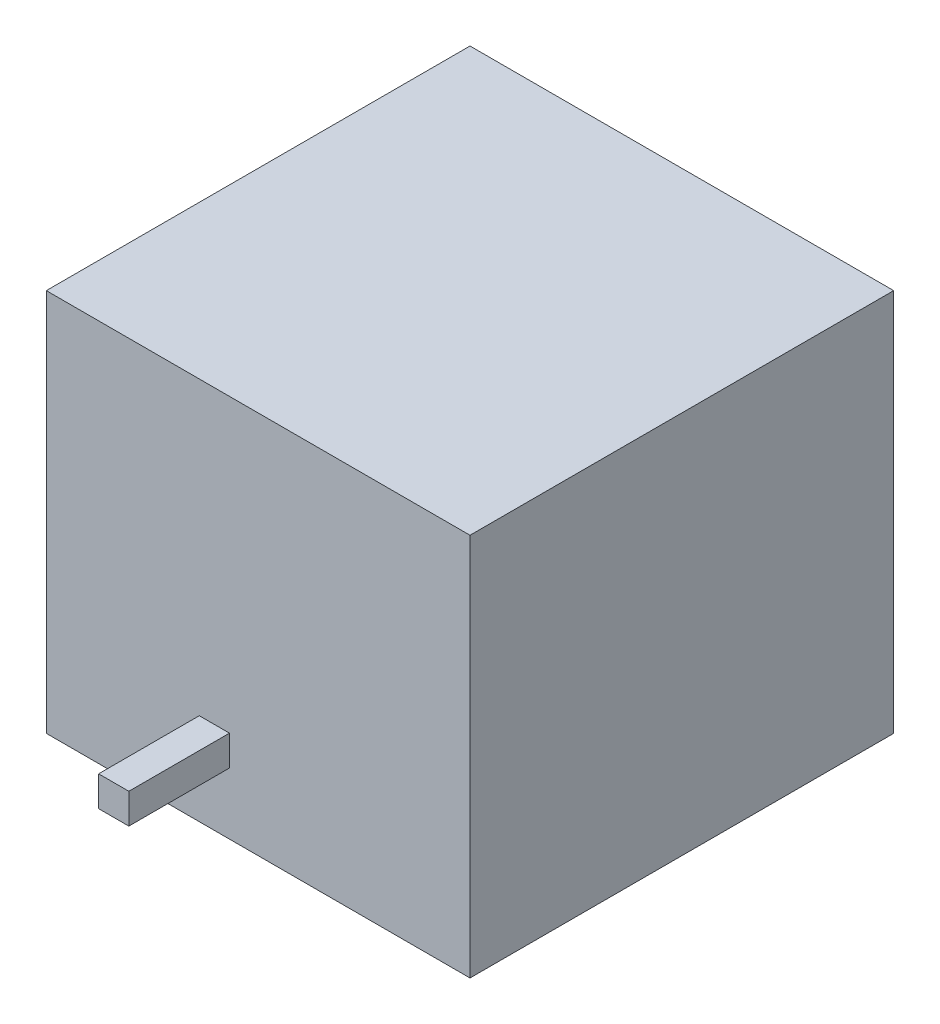
ISO-10303-21;
HEADER;
FILE_DESCRIPTION(('STEP AP214'),'2;1');
FILE_NAME('part.step','',(''),(''),'','','');
FILE_SCHEMA(('AUTOMOTIVE_DESIGN { 1 0 10303 214 1 1 1 1 }'));
ENDSEC;
DATA;
#1=APPLICATION_CONTEXT('core data for automotive mechanical design processes');
#2=APPLICATION_PROTOCOL_DEFINITION('international standard','automotive_design',2000,#1);
#3=PRODUCT_CONTEXT('',#1,'mechanical');
#4=PRODUCT('Part','Part','',(#3));
#5=PRODUCT_RELATED_PRODUCT_CATEGORY('part','',(#4));
#6=PRODUCT_DEFINITION_FORMATION('','',#4);
#7=PRODUCT_DEFINITION_CONTEXT('part definition',#1,'design');
#8=PRODUCT_DEFINITION('design','',#6,#7);
#9=PRODUCT_DEFINITION_SHAPE('','',#8);
#10=(LENGTH_UNIT() NAMED_UNIT(*) SI_UNIT(.MILLI.,.METRE.));
#11=(NAMED_UNIT(*) PLANE_ANGLE_UNIT() SI_UNIT($,.RADIAN.));
#12=(NAMED_UNIT(*) SI_UNIT($,.STERADIAN.) SOLID_ANGLE_UNIT());
#13=UNCERTAINTY_MEASURE_WITH_UNIT(LENGTH_MEASURE(1.E-05),#10,'distance_accuracy_value','');
#14=(GEOMETRIC_REPRESENTATION_CONTEXT(3) GLOBAL_UNCERTAINTY_ASSIGNED_CONTEXT((#13)) GLOBAL_UNIT_ASSIGNED_CONTEXT((#10,
#11,#12)) REPRESENTATION_CONTEXT('',''));
#15=CARTESIAN_POINT('',(0.,0.,0.));
#16=DIRECTION('',(0.,0.,1.));
#17=DIRECTION('',(1.,0.,0.));
#18=AXIS2_PLACEMENT_3D('',#15,#16,#17);
#19=CARTESIAN_POINT('',(0.,38.1,0.));
#20=DIRECTION('',(0.,0.,-1.));
#21=DIRECTION('',(-1.,0.,0.));
#22=AXIS2_PLACEMENT_3D('',#19,#20,#21);
#23=PLANE('',#22);
#24=DIRECTION('',(1.,0.,0.));
#25=VECTOR('',#24,1.);
#26=CARTESIAN_POINT('',(0.,0.,0.));
#27=LINE('',#26,#25);
#28=CARTESIAN_POINT('',(0.,0.,0.));
#29=VERTEX_POINT('',#28);
#30=CARTESIAN_POINT('',(42.1,0.,0.));
#31=VERTEX_POINT('',#30);
#32=EDGE_CURVE('E125',#29,#31,#27,.T.);
#33=ORIENTED_EDGE('',*,*,#32,.T.);
#34=DIRECTION('',(0.,-1.,0.));
#35=VECTOR('',#34,1.);
#36=CARTESIAN_POINT('',(42.1,38.1,0.));
#37=LINE('',#36,#35);
#38=CARTESIAN_POINT('',(42.1,38.1,0.));
#39=VERTEX_POINT('',#38);
#40=EDGE_CURVE('E44',#39,#31,#37,.T.);
#41=ORIENTED_EDGE('',*,*,#40,.F.);
#42=DIRECTION('',(1.,0.,0.));
#43=VECTOR('',#42,1.);
#44=CARTESIAN_POINT('',(0.,38.1,0.));
#45=LINE('',#44,#43);
#46=CARTESIAN_POINT('',(0.,38.1,0.));
#47=VERTEX_POINT('',#46);
#48=EDGE_CURVE('E134',#47,#39,#45,.T.);
#49=ORIENTED_EDGE('',*,*,#48,.F.);
#50=DIRECTION('',(0.,-1.,0.));
#51=VECTOR('',#50,1.);
#52=CARTESIAN_POINT('',(0.,38.1,0.));
#53=LINE('',#52,#51);
#54=EDGE_CURVE('E11',#47,#29,#53,.T.);
#55=ORIENTED_EDGE('',*,*,#54,.T.);
#56=EDGE_LOOP('',(#33,#41,#49,#55));
#57=FACE_BOUND('',#56,.T.);
#58=DIRECTION('',(0.,-1.,0.));
#59=VECTOR('',#58,1.);
#60=CARTESIAN_POINT('',(15.2,9.12,0.));
#61=LINE('',#60,#59);
#62=CARTESIAN_POINT('',(15.2,9.12,0.));
#63=VERTEX_POINT('',#62);
#64=CARTESIAN_POINT('',(15.2,6.12000000000001,0.));
#65=VERTEX_POINT('',#64);
#66=EDGE_CURVE('E121',#63,#65,#61,.T.);
#67=ORIENTED_EDGE('',*,*,#66,.F.);
#68=DIRECTION('',(-1.,0.,0.));
#69=VECTOR('',#68,1.);
#70=CARTESIAN_POINT('',(15.2,9.12,0.));
#71=LINE('',#70,#69);
#72=CARTESIAN_POINT('',(18.2,9.12,0.));
#73=VERTEX_POINT('',#72);
#74=EDGE_CURVE('E118',#73,#63,#71,.T.);
#75=ORIENTED_EDGE('',*,*,#74,.F.);
#76=DIRECTION('',(0.,1.,0.));
#77=VECTOR('',#76,1.);
#78=CARTESIAN_POINT('',(18.2,9.12,0.));
#79=LINE('',#78,#77);
#80=CARTESIAN_POINT('',(18.2,6.12000000000001,0.));
#81=VERTEX_POINT('',#80);
#82=EDGE_CURVE('E56',#81,#73,#79,.T.);
#83=ORIENTED_EDGE('',*,*,#82,.F.);
#84=DIRECTION('',(1.,0.,0.));
#85=VECTOR('',#84,1.);
#86=CARTESIAN_POINT('',(15.2,6.12000000000001,0.));
#87=LINE('',#86,#85);
#88=EDGE_CURVE('E51',#65,#81,#87,.T.);
#89=ORIENTED_EDGE('',*,*,#88,.F.);
#90=EDGE_LOOP('',(#67,#75,#83,#89));
#91=FACE_BOUND('',#90,.T.);
#92=ADVANCED_FACE('F36',(#57,#91),#23,.F.);
#93=CARTESIAN_POINT('',(0.,38.1,0.));
#94=DIRECTION('',(1.,0.,0.));
#95=DIRECTION('',(0.,0.,-1.));
#96=AXIS2_PLACEMENT_3D('',#93,#94,#95);
#97=PLANE('',#96);
#98=DIRECTION('',(0.,0.,1.));
#99=VECTOR('',#98,1.);
#100=CARTESIAN_POINT('',(0.,0.,0.));
#101=LINE('',#100,#99);
#102=CARTESIAN_POINT('',(0.,0.,-42.1));
#103=VERTEX_POINT('',#102);
#104=EDGE_CURVE('E122',#103,#29,#101,.T.);
#105=ORIENTED_EDGE('',*,*,#104,.T.);
#106=ORIENTED_EDGE('',*,*,#54,.F.);
#107=DIRECTION('',(0.,0.,1.));
#108=VECTOR('',#107,1.);
#109=CARTESIAN_POINT('',(0.,38.1,0.));
#110=LINE('',#109,#108);
#111=CARTESIAN_POINT('',(0.,38.1,-42.1));
#112=VERTEX_POINT('',#111);
#113=EDGE_CURVE('E131',#112,#47,#110,.T.);
#114=ORIENTED_EDGE('',*,*,#113,.F.);
#115=DIRECTION('',(0.,-1.,0.));
#116=VECTOR('',#115,1.);
#117=CARTESIAN_POINT('',(0.,38.1,-42.1));
#118=LINE('',#117,#116);
#119=EDGE_CURVE('E140',#112,#103,#118,.T.);
#120=ORIENTED_EDGE('',*,*,#119,.T.);
#121=EDGE_LOOP('',(#105,#106,#114,#120));
#122=FACE_BOUND('',#121,.T.);
#123=ADVANCED_FACE('F38',(#122),#97,.F.);
#124=CARTESIAN_POINT('',(42.1,38.1,0.));
#125=DIRECTION('',(-1.,0.,0.));
#126=DIRECTION('',(0.,0.,1.));
#127=AXIS2_PLACEMENT_3D('',#124,#125,#126);
#128=PLANE('',#127);
#129=DIRECTION('',(0.,0.,-1.));
#130=VECTOR('',#129,1.);
#131=CARTESIAN_POINT('',(42.1,0.,0.));
#132=LINE('',#131,#130);
#133=CARTESIAN_POINT('',(42.1,0.,-42.1));
#134=VERTEX_POINT('',#133);
#135=EDGE_CURVE('E143',#31,#134,#132,.T.);
#136=ORIENTED_EDGE('',*,*,#135,.T.);
#137=DIRECTION('',(0.,-1.,0.));
#138=VECTOR('',#137,1.);
#139=CARTESIAN_POINT('',(42.1,38.1,-42.1));
#140=LINE('',#139,#138);
#141=CARTESIAN_POINT('',(42.1,38.1,-42.1));
#142=VERTEX_POINT('',#141);
#143=EDGE_CURVE('E148',#142,#134,#140,.T.);
#144=ORIENTED_EDGE('',*,*,#143,.F.);
#145=DIRECTION('',(0.,0.,-1.));
#146=VECTOR('',#145,1.);
#147=CARTESIAN_POINT('',(42.1,38.1,0.));
#148=LINE('',#147,#146);
#149=EDGE_CURVE('E137',#39,#142,#148,.T.);
#150=ORIENTED_EDGE('',*,*,#149,.F.);
#151=ORIENTED_EDGE('',*,*,#40,.T.);
#152=EDGE_LOOP('',(#136,#144,#150,#151));
#153=FACE_BOUND('',#152,.T.);
#154=ADVANCED_FACE('F155',(#153),#128,.F.);
#155=CARTESIAN_POINT('',(0.,38.1,-42.1));
#156=DIRECTION('',(0.,0.,1.));
#157=DIRECTION('',(1.,0.,0.));
#158=AXIS2_PLACEMENT_3D('',#155,#156,#157);
#159=PLANE('',#158);
#160=DIRECTION('',(-1.,0.,0.));
#161=VECTOR('',#160,1.);
#162=CARTESIAN_POINT('',(0.,0.,-42.1));
#163=LINE('',#162,#161);
#164=EDGE_CURVE('E135',#134,#103,#163,.T.);
#165=ORIENTED_EDGE('',*,*,#164,.T.);
#166=ORIENTED_EDGE('',*,*,#119,.F.);
#167=DIRECTION('',(-1.,0.,0.));
#168=VECTOR('',#167,1.);
#169=CARTESIAN_POINT('',(0.,38.1,-42.1));
#170=LINE('',#169,#168);
#171=EDGE_CURVE('E139',#142,#112,#170,.T.);
#172=ORIENTED_EDGE('',*,*,#171,.F.);
#173=ORIENTED_EDGE('',*,*,#143,.T.);
#174=EDGE_LOOP('',(#165,#166,#172,#173));
#175=FACE_BOUND('',#174,.T.);
#176=ADVANCED_FACE('F164',(#175),#159,.F.);
#177=CARTESIAN_POINT('',(0.,38.1,0.));
#178=DIRECTION('',(0.,-1.,0.));
#179=DIRECTION('',(0.,0.,-1.));
#180=AXIS2_PLACEMENT_3D('',#177,#178,#179);
#181=PLANE('',#180);
#182=ORIENTED_EDGE('',*,*,#113,.T.);
#183=ORIENTED_EDGE('',*,*,#48,.T.);
#184=ORIENTED_EDGE('',*,*,#149,.T.);
#185=ORIENTED_EDGE('',*,*,#171,.T.);
#186=EDGE_LOOP('',(#182,#183,#184,#185));
#187=FACE_BOUND('',#186,.T.);
#188=ADVANCED_FACE('F170',(#187),#181,.F.);
#189=CARTESIAN_POINT('',(0.,0.,0.));
#190=DIRECTION('',(0.,-1.,0.));
#191=DIRECTION('',(0.,0.,-1.));
#192=AXIS2_PLACEMENT_3D('',#189,#190,#191);
#193=PLANE('',#192);
#194=ORIENTED_EDGE('',*,*,#104,.F.);
#195=ORIENTED_EDGE('',*,*,#164,.F.);
#196=ORIENTED_EDGE('',*,*,#135,.F.);
#197=ORIENTED_EDGE('',*,*,#32,.F.);
#198=EDGE_LOOP('',(#194,#195,#196,#197));
#199=FACE_BOUND('',#198,.T.);
#200=ADVANCED_FACE('F161',(#199),#193,.T.);
#201=CARTESIAN_POINT('',(15.2,9.12,10.));
#202=DIRECTION('',(1.,0.,0.));
#203=DIRECTION('',(0.,0.,-1.));
#204=AXIS2_PLACEMENT_3D('',#201,#202,#203);
#205=PLANE('',#204);
#206=ORIENTED_EDGE('',*,*,#66,.T.);
#207=DIRECTION('',(0.,0.,-1.));
#208=VECTOR('',#207,1.);
#209=CARTESIAN_POINT('',(15.2,6.12000000000001,10.));
#210=LINE('',#209,#208);
#211=CARTESIAN_POINT('',(15.2,6.12000000000001,10.));
#212=VERTEX_POINT('',#211);
#213=EDGE_CURVE('E102',#212,#65,#210,.T.);
#214=ORIENTED_EDGE('',*,*,#213,.F.);
#215=DIRECTION('',(0.,-1.,0.));
#216=VECTOR('',#215,1.);
#217=CARTESIAN_POINT('',(15.2,9.12,10.));
#218=LINE('',#217,#216);
#219=CARTESIAN_POINT('',(15.2,9.12,10.));
#220=VERTEX_POINT('',#219);
#221=EDGE_CURVE('E109',#220,#212,#218,.T.);
#222=ORIENTED_EDGE('',*,*,#221,.F.);
#223=DIRECTION('',(0.,0.,-1.));
#224=VECTOR('',#223,1.);
#225=CARTESIAN_POINT('',(15.2,9.12,10.));
#226=LINE('',#225,#224);
#227=EDGE_CURVE('E177',#220,#63,#226,.T.);
#228=ORIENTED_EDGE('',*,*,#227,.T.);
#229=EDGE_LOOP('',(#206,#214,#222,#228));
#230=FACE_BOUND('',#229,.T.);
#231=ADVANCED_FACE('F120',(#230),#205,.F.);
#232=CARTESIAN_POINT('',(15.2,6.12000000000001,10.));
#233=DIRECTION('',(0.,1.,0.));
#234=DIRECTION('',(0.,0.,1.));
#235=AXIS2_PLACEMENT_3D('',#232,#233,#234);
#236=PLANE('',#235);
#237=ORIENTED_EDGE('',*,*,#88,.T.);
#238=DIRECTION('',(0.,0.,-1.));
#239=VECTOR('',#238,1.);
#240=CARTESIAN_POINT('',(18.2,6.12000000000001,10.));
#241=LINE('',#240,#239);
#242=CARTESIAN_POINT('',(18.2,6.12000000000001,10.));
#243=VERTEX_POINT('',#242);
#244=EDGE_CURVE('E105',#243,#81,#241,.T.);
#245=ORIENTED_EDGE('',*,*,#244,.F.);
#246=DIRECTION('',(1.,0.,0.));
#247=VECTOR('',#246,1.);
#248=CARTESIAN_POINT('',(15.2,6.12000000000001,10.));
#249=LINE('',#248,#247);
#250=EDGE_CURVE('E98',#212,#243,#249,.T.);
#251=ORIENTED_EDGE('',*,*,#250,.F.);
#252=ORIENTED_EDGE('',*,*,#213,.T.);
#253=EDGE_LOOP('',(#237,#245,#251,#252));
#254=FACE_BOUND('',#253,.T.);
#255=ADVANCED_FACE('F100',(#254),#236,.F.);
#256=CARTESIAN_POINT('',(18.2,9.12,10.));
#257=DIRECTION('',(-1.,0.,0.));
#258=DIRECTION('',(0.,0.,1.));
#259=AXIS2_PLACEMENT_3D('',#256,#257,#258);
#260=PLANE('',#259);
#261=ORIENTED_EDGE('',*,*,#82,.T.);
#262=DIRECTION('',(0.,0.,-1.));
#263=VECTOR('',#262,1.);
#264=CARTESIAN_POINT('',(18.2,9.12,10.));
#265=LINE('',#264,#263);
#266=CARTESIAN_POINT('',(18.2,9.12,10.));
#267=VERTEX_POINT('',#266);
#268=EDGE_CURVE('E127',#267,#73,#265,.T.);
#269=ORIENTED_EDGE('',*,*,#268,.F.);
#270=DIRECTION('',(0.,1.,0.));
#271=VECTOR('',#270,1.);
#272=CARTESIAN_POINT('',(18.2,9.12,10.));
#273=LINE('',#272,#271);
#274=EDGE_CURVE('E108',#243,#267,#273,.T.);
#275=ORIENTED_EDGE('',*,*,#274,.F.);
#276=ORIENTED_EDGE('',*,*,#244,.T.);
#277=EDGE_LOOP('',(#261,#269,#275,#276));
#278=FACE_BOUND('',#277,.T.);
#279=ADVANCED_FACE('F186',(#278),#260,.F.);
#280=CARTESIAN_POINT('',(15.2,9.12,10.));
#281=DIRECTION('',(0.,-1.,0.));
#282=DIRECTION('',(0.,0.,-1.));
#283=AXIS2_PLACEMENT_3D('',#280,#281,#282);
#284=PLANE('',#283);
#285=ORIENTED_EDGE('',*,*,#74,.T.);
#286=ORIENTED_EDGE('',*,*,#227,.F.);
#287=DIRECTION('',(-1.,0.,0.));
#288=VECTOR('',#287,1.);
#289=CARTESIAN_POINT('',(15.2,9.12,10.));
#290=LINE('',#289,#288);
#291=EDGE_CURVE('E114',#267,#220,#290,.T.);
#292=ORIENTED_EDGE('',*,*,#291,.F.);
#293=ORIENTED_EDGE('',*,*,#268,.T.);
#294=EDGE_LOOP('',(#285,#286,#292,#293));
#295=FACE_BOUND('',#294,.T.);
#296=ADVANCED_FACE('F176',(#295),#284,.F.);
#297=CARTESIAN_POINT('',(0.,0.,10.));
#298=DIRECTION('',(0.,0.,1.));
#299=DIRECTION('',(1.,0.,0.));
#300=AXIS2_PLACEMENT_3D('',#297,#298,#299);
#301=PLANE('',#300);
#302=ORIENTED_EDGE('',*,*,#221,.T.);
#303=ORIENTED_EDGE('',*,*,#250,.T.);
#304=ORIENTED_EDGE('',*,*,#274,.T.);
#305=ORIENTED_EDGE('',*,*,#291,.T.);
#306=EDGE_LOOP('',(#302,#303,#304,#305));
#307=FACE_BOUND('',#306,.T.);
#308=ADVANCED_FACE('F112',(#307),#301,.T.);
#309=CLOSED_SHELL('',(#92,#123,#154,#176,#188,#200,#231,#255,#279,#296,#308));
#310=MANIFOLD_SOLID_BREP('B2',#309);
#311=ADVANCED_BREP_SHAPE_REPRESENTATION('',(#18,#310),#14);
#312=SHAPE_DEFINITION_REPRESENTATION(#9,#311);
ENDSEC;
END-ISO-10303-21;
